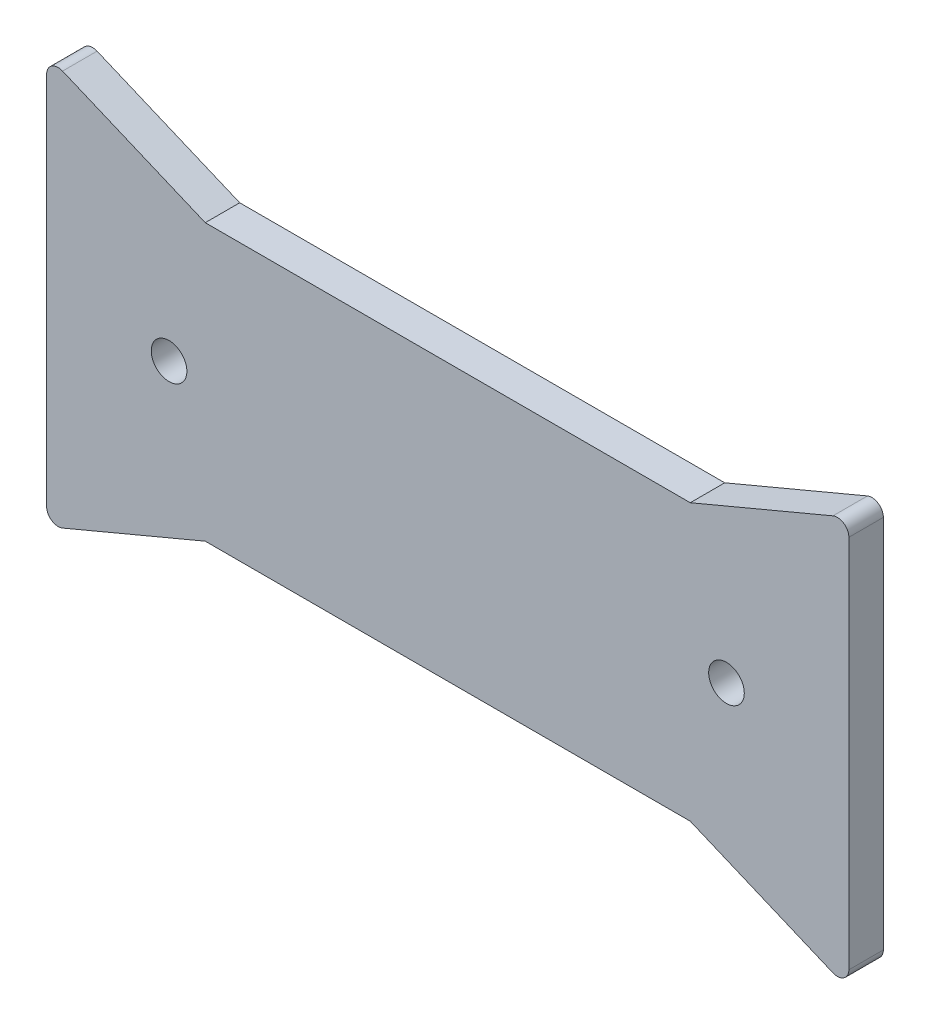
ISO-10303-21;
HEADER;
FILE_DESCRIPTION(('STEP AP214'),'2;1');
FILE_NAME('part.step','',(''),(''),'','','');
FILE_SCHEMA(('AUTOMOTIVE_DESIGN { 1 0 10303 214 1 1 1 1 }'));
ENDSEC;
DATA;
#1=APPLICATION_CONTEXT('core data for automotive mechanical design processes');
#2=APPLICATION_PROTOCOL_DEFINITION('international standard','automotive_design',2000,#1);
#3=PRODUCT_CONTEXT('',#1,'mechanical');
#4=PRODUCT('Part','Part','',(#3));
#5=PRODUCT_RELATED_PRODUCT_CATEGORY('part','',(#4));
#6=PRODUCT_DEFINITION_FORMATION('','',#4);
#7=PRODUCT_DEFINITION_CONTEXT('part definition',#1,'design');
#8=PRODUCT_DEFINITION('design','',#6,#7);
#9=PRODUCT_DEFINITION_SHAPE('','',#8);
#10=(LENGTH_UNIT() NAMED_UNIT(*) SI_UNIT(.MILLI.,.METRE.));
#11=(NAMED_UNIT(*) PLANE_ANGLE_UNIT() SI_UNIT($,.RADIAN.));
#12=(NAMED_UNIT(*) SI_UNIT($,.STERADIAN.) SOLID_ANGLE_UNIT());
#13=UNCERTAINTY_MEASURE_WITH_UNIT(LENGTH_MEASURE(1.E-05),#10,'distance_accuracy_value','');
#14=(GEOMETRIC_REPRESENTATION_CONTEXT(3) GLOBAL_UNCERTAINTY_ASSIGNED_CONTEXT((#13)) GLOBAL_UNIT_ASSIGNED_CONTEXT((#10,
#11,#12)) REPRESENTATION_CONTEXT('',''));
#15=CARTESIAN_POINT('',(0.,0.,0.));
#16=DIRECTION('',(0.,0.,1.));
#17=DIRECTION('',(1.,0.,0.));
#18=AXIS2_PLACEMENT_3D('',#15,#16,#17);
#19=CARTESIAN_POINT('',(-34.9,-12.,3.));
#20=DIRECTION('',(1.,0.,0.));
#21=DIRECTION('',(0.,0.,-1.));
#22=AXIS2_PLACEMENT_3D('',#19,#20,#21);
#23=PLANE('',#22);
#24=DIRECTION('',(0.,-1.,0.));
#25=VECTOR('',#24,1.);
#26=CARTESIAN_POINT('',(-34.9,-12.,0.));
#27=LINE('',#26,#25);
#28=CARTESIAN_POINT('',(-34.9,16.2949781216716,0.));
#29=VERTEX_POINT('',#28);
#30=CARTESIAN_POINT('',(-34.9,-16.2949781216716,0.));
#31=VERTEX_POINT('',#30);
#32=EDGE_CURVE('E164',#29,#31,#27,.T.);
#33=ORIENTED_EDGE('',*,*,#32,.T.);
#34=DIRECTION('',(0.,0.,-1.));
#35=VECTOR('',#34,1.);
#36=CARTESIAN_POINT('',(-34.9,-16.2949781216716,3.));
#37=LINE('',#36,#35);
#38=CARTESIAN_POINT('',(-34.9,-16.2949781216716,3.));
#39=VERTEX_POINT('',#38);
#40=EDGE_CURVE('E41',#31,#39,#37,.F.);
#41=ORIENTED_EDGE('',*,*,#40,.T.);
#42=DIRECTION('',(0.,-1.,0.));
#43=VECTOR('',#42,1.);
#44=CARTESIAN_POINT('',(-34.9,12.,3.));
#45=LINE('',#44,#43);
#46=CARTESIAN_POINT('',(-34.9,16.2949781216716,3.));
#47=VERTEX_POINT('',#46);
#48=EDGE_CURVE('E136',#47,#39,#45,.T.);
#49=ORIENTED_EDGE('',*,*,#48,.F.);
#50=DIRECTION('',(0.,0.,-1.));
#51=VECTOR('',#50,1.);
#52=CARTESIAN_POINT('',(-34.9,16.2949781216716,3.));
#53=LINE('',#52,#51);
#54=EDGE_CURVE('E213',#47,#29,#53,.T.);
#55=ORIENTED_EDGE('',*,*,#54,.T.);
#56=EDGE_LOOP('',(#33,#41,#49,#55));
#57=FACE_BOUND('',#56,.T.);
#58=ADVANCED_FACE('F33',(#57),#23,.F.);
#59=CARTESIAN_POINT('',(-34.9,-17.8,3.));
#60=DIRECTION('',(-0.387459617732069,0.921886676672854,0.));
#61=DIRECTION('',(-0.921886676672854,-0.387459617732069,0.));
#62=AXIS2_PLACEMENT_3D('',#59,#60,#61);
#63=PLANE('',#62);
#64=DIRECTION('',(0.921886676672854,0.387459617732069,0.));
#65=VECTOR('',#64,1.);
#66=CARTESIAN_POINT('',(-34.9,-17.8,3.));
#67=LINE('',#66,#65);
#68=CARTESIAN_POINT('',(-33.5125403822679,-17.2168647983445,3.));
#69=VERTEX_POINT('',#68);
#70=CARTESIAN_POINT('',(-21.1,-12.,3.));
#71=VERTEX_POINT('',#70);
#72=EDGE_CURVE('E123',#69,#71,#67,.T.);
#73=ORIENTED_EDGE('',*,*,#72,.F.);
#74=DIRECTION('',(0.,0.,-1.));
#75=VECTOR('',#74,1.);
#76=CARTESIAN_POINT('',(-33.5125403822679,-17.2168647983445,3.));
#77=LINE('',#76,#75);
#78=CARTESIAN_POINT('',(-33.5125403822679,-17.2168647983445,0.));
#79=VERTEX_POINT('',#78);
#80=EDGE_CURVE('E211',#69,#79,#77,.T.);
#81=ORIENTED_EDGE('',*,*,#80,.T.);
#82=DIRECTION('',(0.921886676672854,0.387459617732069,0.));
#83=VECTOR('',#82,1.);
#84=CARTESIAN_POINT('',(-34.9,-17.8,0.));
#85=LINE('',#84,#83);
#86=CARTESIAN_POINT('',(-21.1,-12.,0.));
#87=VERTEX_POINT('',#86);
#88=EDGE_CURVE('E142',#79,#87,#85,.T.);
#89=ORIENTED_EDGE('',*,*,#88,.T.);
#90=DIRECTION('',(0.,0.,-1.));
#91=VECTOR('',#90,1.);
#92=CARTESIAN_POINT('',(-21.1,-12.,3.));
#93=LINE('',#92,#91);
#94=EDGE_CURVE('E139',#71,#87,#93,.T.);
#95=ORIENTED_EDGE('',*,*,#94,.F.);
#96=EDGE_LOOP('',(#73,#81,#89,#95));
#97=FACE_BOUND('',#96,.T.);
#98=ADVANCED_FACE('F140',(#97),#63,.F.);
#99=CARTESIAN_POINT('',(21.1,-12.,3.));
#100=DIRECTION('',(0.,1.,0.));
#101=DIRECTION('',(0.,0.,1.));
#102=AXIS2_PLACEMENT_3D('',#99,#100,#101);
#103=PLANE('',#102);
#104=DIRECTION('',(1.,0.,0.));
#105=VECTOR('',#104,1.);
#106=CARTESIAN_POINT('',(21.1,-12.,0.));
#107=LINE('',#106,#105);
#108=CARTESIAN_POINT('',(21.1,-12.,0.));
#109=VERTEX_POINT('',#108);
#110=EDGE_CURVE('E169',#87,#109,#107,.T.);
#111=ORIENTED_EDGE('',*,*,#110,.T.);
#112=DIRECTION('',(0.,0.,-1.));
#113=VECTOR('',#112,1.);
#114=CARTESIAN_POINT('',(21.1,-12.,3.));
#115=LINE('',#114,#113);
#116=CARTESIAN_POINT('',(21.1,-12.,3.));
#117=VERTEX_POINT('',#116);
#118=EDGE_CURVE('E146',#117,#109,#115,.T.);
#119=ORIENTED_EDGE('',*,*,#118,.F.);
#120=DIRECTION('',(1.,0.,0.));
#121=VECTOR('',#120,1.);
#122=CARTESIAN_POINT('',(21.1,-12.,3.));
#123=LINE('',#122,#121);
#124=EDGE_CURVE('E128',#71,#117,#123,.T.);
#125=ORIENTED_EDGE('',*,*,#124,.F.);
#126=ORIENTED_EDGE('',*,*,#94,.T.);
#127=EDGE_LOOP('',(#111,#119,#125,#126));
#128=FACE_BOUND('',#127,.T.);
#129=ADVANCED_FACE('F148',(#128),#103,.F.);
#130=CARTESIAN_POINT('',(34.9,-17.8,3.));
#131=DIRECTION('',(0.387459617732069,0.921886676672854,0.));
#132=DIRECTION('',(-0.921886676672854,0.387459617732069,0.));
#133=AXIS2_PLACEMENT_3D('',#130,#131,#132);
#134=PLANE('',#133);
#135=DIRECTION('',(0.921886676672854,-0.387459617732069,0.));
#136=VECTOR('',#135,1.);
#137=CARTESIAN_POINT('',(34.9,-17.8,0.));
#138=LINE('',#137,#136);
#139=CARTESIAN_POINT('',(33.5125403822679,-17.2168647983445,0.));
#140=VERTEX_POINT('',#139);
#141=EDGE_CURVE('E171',#109,#140,#138,.T.);
#142=ORIENTED_EDGE('',*,*,#141,.T.);
#143=DIRECTION('',(0.,0.,-1.));
#144=VECTOR('',#143,1.);
#145=CARTESIAN_POINT('',(33.5125403822679,-17.2168647983445,3.));
#146=LINE('',#145,#144);
#147=CARTESIAN_POINT('',(33.5125403822679,-17.2168647983445,3.));
#148=VERTEX_POINT('',#147);
#149=EDGE_CURVE('E54',#140,#148,#146,.F.);
#150=ORIENTED_EDGE('',*,*,#149,.T.);
#151=DIRECTION('',(0.921886676672854,-0.387459617732069,0.));
#152=VECTOR('',#151,1.);
#153=CARTESIAN_POINT('',(34.9,-17.8,3.));
#154=LINE('',#153,#152);
#155=EDGE_CURVE('E150',#117,#148,#154,.T.);
#156=ORIENTED_EDGE('',*,*,#155,.F.);
#157=ORIENTED_EDGE('',*,*,#118,.T.);
#158=EDGE_LOOP('',(#142,#150,#156,#157));
#159=FACE_BOUND('',#158,.T.);
#160=ADVANCED_FACE('F227',(#159),#134,.F.);
#161=CARTESIAN_POINT('',(34.9,12.,3.));
#162=DIRECTION('',(-1.,0.,0.));
#163=DIRECTION('',(0.,0.,1.));
#164=AXIS2_PLACEMENT_3D('',#161,#162,#163);
#165=PLANE('',#164);
#166=DIRECTION('',(0.,1.,0.));
#167=VECTOR('',#166,1.);
#168=CARTESIAN_POINT('',(34.9,12.,0.));
#169=LINE('',#168,#167);
#170=CARTESIAN_POINT('',(34.9,-16.2949781216716,0.));
#171=VERTEX_POINT('',#170);
#172=CARTESIAN_POINT('',(34.9,16.2949781216716,0.));
#173=VERTEX_POINT('',#172);
#174=EDGE_CURVE('E173',#171,#173,#169,.T.);
#175=ORIENTED_EDGE('',*,*,#174,.T.);
#176=DIRECTION('',(0.,0.,-1.));
#177=VECTOR('',#176,1.);
#178=CARTESIAN_POINT('',(34.9,16.2949781216716,3.));
#179=LINE('',#178,#177);
#180=CARTESIAN_POINT('',(34.9,16.2949781216716,3.));
#181=VERTEX_POINT('',#180);
#182=EDGE_CURVE('E201',#173,#181,#179,.F.);
#183=ORIENTED_EDGE('',*,*,#182,.T.);
#184=DIRECTION('',(0.,1.,0.));
#185=VECTOR('',#184,1.);
#186=CARTESIAN_POINT('',(34.9,-12.,3.));
#187=LINE('',#186,#185);
#188=CARTESIAN_POINT('',(34.9,-16.2949781216716,3.));
#189=VERTEX_POINT('',#188);
#190=EDGE_CURVE('E152',#189,#181,#187,.T.);
#191=ORIENTED_EDGE('',*,*,#190,.F.);
#192=DIRECTION('',(0.,0.,-1.));
#193=VECTOR('',#192,1.);
#194=CARTESIAN_POINT('',(34.9,-16.2949781216716,3.));
#195=LINE('',#194,#193);
#196=EDGE_CURVE('E198',#189,#171,#195,.T.);
#197=ORIENTED_EDGE('',*,*,#196,.T.);
#198=EDGE_LOOP('',(#175,#183,#191,#197));
#199=FACE_BOUND('',#198,.T.);
#200=ADVANCED_FACE('F235',(#199),#165,.F.);
#201=CARTESIAN_POINT('',(34.9,17.8,3.));
#202=DIRECTION('',(0.387459617732069,-0.921886676672854,0.));
#203=DIRECTION('',(0.921886676672854,0.387459617732069,0.));
#204=AXIS2_PLACEMENT_3D('',#201,#202,#203);
#205=PLANE('',#204);
#206=DIRECTION('',(-0.921886676672854,-0.387459617732069,0.));
#207=VECTOR('',#206,1.);
#208=CARTESIAN_POINT('',(34.9,17.8,3.));
#209=LINE('',#208,#207);
#210=CARTESIAN_POINT('',(33.5125403822679,17.2168647983445,3.));
#211=VERTEX_POINT('',#210);
#212=CARTESIAN_POINT('',(21.1,12.,3.));
#213=VERTEX_POINT('',#212);
#214=EDGE_CURVE('E157',#211,#213,#209,.T.);
#215=ORIENTED_EDGE('',*,*,#214,.F.);
#216=DIRECTION('',(0.,0.,-1.));
#217=VECTOR('',#216,1.);
#218=CARTESIAN_POINT('',(33.5125403822679,17.2168647983445,3.));
#219=LINE('',#218,#217);
#220=CARTESIAN_POINT('',(33.5125403822679,17.2168647983445,0.));
#221=VERTEX_POINT('',#220);
#222=EDGE_CURVE('E145',#211,#221,#219,.T.);
#223=ORIENTED_EDGE('',*,*,#222,.T.);
#224=DIRECTION('',(-0.921886676672854,-0.387459617732069,0.));
#225=VECTOR('',#224,1.);
#226=CARTESIAN_POINT('',(34.9,17.8,0.));
#227=LINE('',#226,#225);
#228=CARTESIAN_POINT('',(21.1,12.,0.));
#229=VERTEX_POINT('',#228);
#230=EDGE_CURVE('E176',#221,#229,#227,.T.);
#231=ORIENTED_EDGE('',*,*,#230,.T.);
#232=DIRECTION('',(0.,0.,-1.));
#233=VECTOR('',#232,1.);
#234=CARTESIAN_POINT('',(21.1,12.,3.));
#235=LINE('',#234,#233);
#236=EDGE_CURVE('E184',#213,#229,#235,.T.);
#237=ORIENTED_EDGE('',*,*,#236,.F.);
#238=EDGE_LOOP('',(#215,#223,#231,#237));
#239=FACE_BOUND('',#238,.T.);
#240=ADVANCED_FACE('F244',(#239),#205,.F.);
#241=CARTESIAN_POINT('',(21.1,12.,3.));
#242=DIRECTION('',(0.,-1.,0.));
#243=DIRECTION('',(0.,0.,-1.));
#244=AXIS2_PLACEMENT_3D('',#241,#242,#243);
#245=PLANE('',#244);
#246=DIRECTION('',(-1.,0.,0.));
#247=VECTOR('',#246,1.);
#248=CARTESIAN_POINT('',(21.1,12.,0.));
#249=LINE('',#248,#247);
#250=CARTESIAN_POINT('',(-21.1,12.,0.));
#251=VERTEX_POINT('',#250);
#252=EDGE_CURVE('E178',#229,#251,#249,.T.);
#253=ORIENTED_EDGE('',*,*,#252,.T.);
#254=DIRECTION('',(0.,0.,-1.));
#255=VECTOR('',#254,1.);
#256=CARTESIAN_POINT('',(-21.1,12.,3.));
#257=LINE('',#256,#255);
#258=CARTESIAN_POINT('',(-21.1,12.,3.));
#259=VERTEX_POINT('',#258);
#260=EDGE_CURVE('E163',#259,#251,#257,.T.);
#261=ORIENTED_EDGE('',*,*,#260,.F.);
#262=DIRECTION('',(-1.,0.,0.));
#263=VECTOR('',#262,1.);
#264=CARTESIAN_POINT('',(21.1,12.,3.));
#265=LINE('',#264,#263);
#266=EDGE_CURVE('E159',#213,#259,#265,.T.);
#267=ORIENTED_EDGE('',*,*,#266,.F.);
#268=ORIENTED_EDGE('',*,*,#236,.T.);
#269=EDGE_LOOP('',(#253,#261,#267,#268));
#270=FACE_BOUND('',#269,.T.);
#271=ADVANCED_FACE('F249',(#270),#245,.F.);
#272=CARTESIAN_POINT('',(-34.9,17.8,3.));
#273=DIRECTION('',(-0.387459617732069,-0.921886676672854,0.));
#274=DIRECTION('',(0.921886676672854,-0.387459617732069,0.));
#275=AXIS2_PLACEMENT_3D('',#272,#273,#274);
#276=PLANE('',#275);
#277=DIRECTION('',(-0.921886676672854,0.387459617732069,0.));
#278=VECTOR('',#277,1.);
#279=CARTESIAN_POINT('',(-34.9,17.8,0.));
#280=LINE('',#279,#278);
#281=CARTESIAN_POINT('',(-33.5125403822679,17.2168647983445,0.));
#282=VERTEX_POINT('',#281);
#283=EDGE_CURVE('E180',#251,#282,#280,.T.);
#284=ORIENTED_EDGE('',*,*,#283,.T.);
#285=DIRECTION('',(0.,0.,-1.));
#286=VECTOR('',#285,1.);
#287=CARTESIAN_POINT('',(-33.5125403822679,17.2168647983445,3.));
#288=LINE('',#287,#286);
#289=CARTESIAN_POINT('',(-33.5125403822679,17.2168647983445,3.));
#290=VERTEX_POINT('',#289);
#291=EDGE_CURVE('E11',#282,#290,#288,.F.);
#292=ORIENTED_EDGE('',*,*,#291,.T.);
#293=DIRECTION('',(-0.921886676672854,0.387459617732069,0.));
#294=VECTOR('',#293,1.);
#295=CARTESIAN_POINT('',(-34.9,17.8,3.));
#296=LINE('',#295,#294);
#297=EDGE_CURVE('E161',#259,#290,#296,.T.);
#298=ORIENTED_EDGE('',*,*,#297,.F.);
#299=ORIENTED_EDGE('',*,*,#260,.T.);
#300=EDGE_LOOP('',(#284,#292,#298,#299));
#301=FACE_BOUND('',#300,.T.);
#302=ADVANCED_FACE('F251',(#301),#276,.F.);
#303=CARTESIAN_POINT('',(0.,0.,3.));
#304=DIRECTION('',(0.,0.,1.));
#305=DIRECTION('',(1.,0.,0.));
#306=AXIS2_PLACEMENT_3D('',#303,#304,#305);
#307=PLANE('',#306);
#308=CARTESIAN_POINT('',(-24.25,0.,3.));
#309=DIRECTION('',(0.,0.,1.));
#310=DIRECTION('',(1.,0.,0.));
#311=AXIS2_PLACEMENT_3D('',#308,#309,#310);
#312=CIRCLE('',#311,1.55);
#313=CARTESIAN_POINT('',(-22.7,0.,3.));
#314=VERTEX_POINT('',#313);
#315=EDGE_CURVE('E304',#314,#314,#312,.T.);
#316=ORIENTED_EDGE('',*,*,#315,.F.);
#317=EDGE_LOOP('',(#316));
#318=FACE_BOUND('',#317,.T.);
#319=CARTESIAN_POINT('',(24.25,0.,3.));
#320=DIRECTION('',(0.,0.,1.));
#321=DIRECTION('',(1.,0.,0.));
#322=AXIS2_PLACEMENT_3D('',#319,#320,#321);
#323=CIRCLE('',#322,1.55);
#324=CARTESIAN_POINT('',(25.8,0.,3.));
#325=VERTEX_POINT('',#324);
#326=EDGE_CURVE('E305',#325,#325,#323,.T.);
#327=ORIENTED_EDGE('',*,*,#326,.F.);
#328=EDGE_LOOP('',(#327));
#329=FACE_BOUND('',#328,.T.);
#330=ORIENTED_EDGE('',*,*,#190,.T.);
#331=CARTESIAN_POINT('',(33.9,16.2949781216716,3.));
#332=DIRECTION('',(0.,0.,1.));
#333=DIRECTION('',(1.,0.,0.));
#334=AXIS2_PLACEMENT_3D('',#331,#332,#333);
#335=CIRCLE('',#334,1.);
#336=EDGE_CURVE('E208',#181,#211,#335,.T.);
#337=ORIENTED_EDGE('',*,*,#336,.T.);
#338=ORIENTED_EDGE('',*,*,#214,.T.);
#339=ORIENTED_EDGE('',*,*,#266,.T.);
#340=ORIENTED_EDGE('',*,*,#297,.T.);
#341=CARTESIAN_POINT('',(-33.9,16.2949781216716,3.));
#342=DIRECTION('',(0.,0.,1.));
#343=DIRECTION('',(1.,0.,0.));
#344=AXIS2_PLACEMENT_3D('',#341,#342,#343);
#345=CIRCLE('',#344,1.);
#346=EDGE_CURVE('E203',#290,#47,#345,.T.);
#347=ORIENTED_EDGE('',*,*,#346,.T.);
#348=ORIENTED_EDGE('',*,*,#48,.T.);
#349=CARTESIAN_POINT('',(-33.9,-16.2949781216716,3.));
#350=DIRECTION('',(0.,0.,1.));
#351=DIRECTION('',(1.,0.,0.));
#352=AXIS2_PLACEMENT_3D('',#349,#350,#351);
#353=CIRCLE('',#352,1.);
#354=EDGE_CURVE('E132',#39,#69,#353,.T.);
#355=ORIENTED_EDGE('',*,*,#354,.T.);
#356=ORIENTED_EDGE('',*,*,#72,.T.);
#357=ORIENTED_EDGE('',*,*,#124,.T.);
#358=ORIENTED_EDGE('',*,*,#155,.T.);
#359=CARTESIAN_POINT('',(33.9,-16.2949781216716,3.));
#360=DIRECTION('',(0.,0.,1.));
#361=DIRECTION('',(1.,0.,0.));
#362=AXIS2_PLACEMENT_3D('',#359,#360,#361);
#363=CIRCLE('',#362,1.);
#364=EDGE_CURVE('E206',#148,#189,#363,.T.);
#365=ORIENTED_EDGE('',*,*,#364,.T.);
#366=EDGE_LOOP('',(#330,#337,#338,#339,#340,#347,#348,#355,#356,#357,#358,#365));
#367=FACE_BOUND('',#366,.T.);
#368=ADVANCED_FACE('F126',(#318,#329,#367),#307,.T.);
#369=CARTESIAN_POINT('',(0.,0.,0.));
#370=DIRECTION('',(0.,0.,1.));
#371=DIRECTION('',(1.,0.,0.));
#372=AXIS2_PLACEMENT_3D('',#369,#370,#371);
#373=PLANE('',#372);
#374=CARTESIAN_POINT('',(-24.25,0.,0.));
#375=DIRECTION('',(0.,0.,1.));
#376=DIRECTION('',(1.,0.,0.));
#377=AXIS2_PLACEMENT_3D('',#374,#375,#376);
#378=CIRCLE('',#377,1.55);
#379=CARTESIAN_POINT('',(-22.7,0.,0.));
#380=VERTEX_POINT('',#379);
#381=EDGE_CURVE('E167',#380,#380,#378,.T.);
#382=ORIENTED_EDGE('',*,*,#381,.T.);
#383=EDGE_LOOP('',(#382));
#384=FACE_BOUND('',#383,.T.);
#385=CARTESIAN_POINT('',(24.25,0.,0.));
#386=DIRECTION('',(0.,0.,1.));
#387=DIRECTION('',(1.,0.,0.));
#388=AXIS2_PLACEMENT_3D('',#385,#386,#387);
#389=CIRCLE('',#388,1.55);
#390=CARTESIAN_POINT('',(25.8,0.,0.));
#391=VERTEX_POINT('',#390);
#392=EDGE_CURVE('E303',#391,#391,#389,.T.);
#393=ORIENTED_EDGE('',*,*,#392,.T.);
#394=EDGE_LOOP('',(#393));
#395=FACE_BOUND('',#394,.T.);
#396=ORIENTED_EDGE('',*,*,#230,.F.);
#397=CARTESIAN_POINT('',(33.9,16.2949781216716,0.));
#398=DIRECTION('',(0.,0.,1.));
#399=DIRECTION('',(1.,0.,0.));
#400=AXIS2_PLACEMENT_3D('',#397,#398,#399);
#401=CIRCLE('',#400,1.);
#402=EDGE_CURVE('E196',#221,#173,#401,.F.);
#403=ORIENTED_EDGE('',*,*,#402,.T.);
#404=ORIENTED_EDGE('',*,*,#174,.F.);
#405=CARTESIAN_POINT('',(33.9,-16.2949781216716,0.));
#406=DIRECTION('',(0.,0.,1.));
#407=DIRECTION('',(1.,0.,0.));
#408=AXIS2_PLACEMENT_3D('',#405,#406,#407);
#409=CIRCLE('',#408,1.);
#410=EDGE_CURVE('E194',#171,#140,#409,.F.);
#411=ORIENTED_EDGE('',*,*,#410,.T.);
#412=ORIENTED_EDGE('',*,*,#141,.F.);
#413=ORIENTED_EDGE('',*,*,#110,.F.);
#414=ORIENTED_EDGE('',*,*,#88,.F.);
#415=CARTESIAN_POINT('',(-33.9,-16.2949781216716,0.));
#416=DIRECTION('',(0.,0.,1.));
#417=DIRECTION('',(1.,0.,0.));
#418=AXIS2_PLACEMENT_3D('',#415,#416,#417);
#419=CIRCLE('',#418,1.);
#420=EDGE_CURVE('E192',#79,#31,#419,.F.);
#421=ORIENTED_EDGE('',*,*,#420,.T.);
#422=ORIENTED_EDGE('',*,*,#32,.F.);
#423=CARTESIAN_POINT('',(-33.9,16.2949781216716,0.));
#424=DIRECTION('',(0.,0.,1.));
#425=DIRECTION('',(1.,0.,0.));
#426=AXIS2_PLACEMENT_3D('',#423,#424,#425);
#427=CIRCLE('',#426,1.);
#428=EDGE_CURVE('E190',#29,#282,#427,.F.);
#429=ORIENTED_EDGE('',*,*,#428,.T.);
#430=ORIENTED_EDGE('',*,*,#283,.F.);
#431=ORIENTED_EDGE('',*,*,#252,.F.);
#432=EDGE_LOOP('',(#396,#403,#404,#411,#412,#413,#414,#421,#422,#429,#430,#431));
#433=FACE_BOUND('',#432,.T.);
#434=ADVANCED_FACE('F225',(#384,#395,#433),#373,.F.);
#435=CARTESIAN_POINT('',(33.9,16.2949781216716,3.));
#436=DIRECTION('',(0.,0.,-1.));
#437=DIRECTION('',(-1.,0.,0.));
#438=AXIS2_PLACEMENT_3D('',#435,#436,#437);
#439=CYLINDRICAL_SURFACE('',#438,1.);
#440=ORIENTED_EDGE('',*,*,#336,.F.);
#441=ORIENTED_EDGE('',*,*,#182,.F.);
#442=ORIENTED_EDGE('',*,*,#402,.F.);
#443=ORIENTED_EDGE('',*,*,#222,.F.);
#444=EDGE_LOOP('',(#440,#441,#442,#443));
#445=FACE_BOUND('',#444,.T.);
#446=ADVANCED_FACE('F241',(#445),#439,.T.);
#447=CARTESIAN_POINT('',(33.9,-16.2949781216716,3.));
#448=DIRECTION('',(0.,0.,-1.));
#449=DIRECTION('',(-1.,0.,0.));
#450=AXIS2_PLACEMENT_3D('',#447,#448,#449);
#451=CYLINDRICAL_SURFACE('',#450,1.);
#452=ORIENTED_EDGE('',*,*,#364,.F.);
#453=ORIENTED_EDGE('',*,*,#149,.F.);
#454=ORIENTED_EDGE('',*,*,#410,.F.);
#455=ORIENTED_EDGE('',*,*,#196,.F.);
#456=EDGE_LOOP('',(#452,#453,#454,#455));
#457=FACE_BOUND('',#456,.T.);
#458=ADVANCED_FACE('F232',(#457),#451,.T.);
#459=CARTESIAN_POINT('',(-33.9,-16.2949781216716,3.));
#460=DIRECTION('',(0.,0.,-1.));
#461=DIRECTION('',(-1.,0.,0.));
#462=AXIS2_PLACEMENT_3D('',#459,#460,#461);
#463=CYLINDRICAL_SURFACE('',#462,1.);
#464=ORIENTED_EDGE('',*,*,#354,.F.);
#465=ORIENTED_EDGE('',*,*,#40,.F.);
#466=ORIENTED_EDGE('',*,*,#420,.F.);
#467=ORIENTED_EDGE('',*,*,#80,.F.);
#468=EDGE_LOOP('',(#464,#465,#466,#467));
#469=FACE_BOUND('',#468,.T.);
#470=ADVANCED_FACE('F222',(#469),#463,.T.);
#471=CARTESIAN_POINT('',(-33.9,16.2949781216716,3.));
#472=DIRECTION('',(0.,0.,-1.));
#473=DIRECTION('',(-1.,0.,0.));
#474=AXIS2_PLACEMENT_3D('',#471,#472,#473);
#475=CYLINDRICAL_SURFACE('',#474,1.);
#476=ORIENTED_EDGE('',*,*,#346,.F.);
#477=ORIENTED_EDGE('',*,*,#291,.F.);
#478=ORIENTED_EDGE('',*,*,#428,.F.);
#479=ORIENTED_EDGE('',*,*,#54,.F.);
#480=EDGE_LOOP('',(#476,#477,#478,#479));
#481=FACE_BOUND('',#480,.T.);
#482=ADVANCED_FACE('F35',(#481),#475,.T.);
#483=CARTESIAN_POINT('',(24.25,0.,0.));
#484=DIRECTION('',(0.,0.,1.));
#485=DIRECTION('',(1.,0.,0.));
#486=AXIS2_PLACEMENT_3D('',#483,#484,#485);
#487=CYLINDRICAL_SURFACE('',#486,1.55);
#488=ORIENTED_EDGE('',*,*,#392,.F.);
#489=EDGE_LOOP('',(#488));
#490=FACE_BOUND('',#489,.T.);
#491=ORIENTED_EDGE('',*,*,#326,.T.);
#492=EDGE_LOOP('',(#491));
#493=FACE_BOUND('',#492,.T.);
#494=ADVANCED_FACE('F280',(#490,#493),#487,.F.);
#495=CARTESIAN_POINT('',(-24.25,0.,0.));
#496=DIRECTION('',(0.,0.,1.));
#497=DIRECTION('',(1.,0.,0.));
#498=AXIS2_PLACEMENT_3D('',#495,#496,#497);
#499=CYLINDRICAL_SURFACE('',#498,1.55);
#500=ORIENTED_EDGE('',*,*,#381,.F.);
#501=EDGE_LOOP('',(#500));
#502=FACE_BOUND('',#501,.T.);
#503=ORIENTED_EDGE('',*,*,#315,.T.);
#504=EDGE_LOOP('',(#503));
#505=FACE_BOUND('',#504,.T.);
#506=ADVANCED_FACE('F285',(#502,#505),#499,.F.);
#507=CLOSED_SHELL('',(#58,#98,#129,#160,#200,#240,#271,#302,#368,#434,#446,#458,#470,#482,#494,#506));
#508=MANIFOLD_SOLID_BREP('B2',#507);
#509=ADVANCED_BREP_SHAPE_REPRESENTATION('',(#18,#508),#14);
#510=SHAPE_DEFINITION_REPRESENTATION(#9,#509);
ENDSEC;
END-ISO-10303-21;
